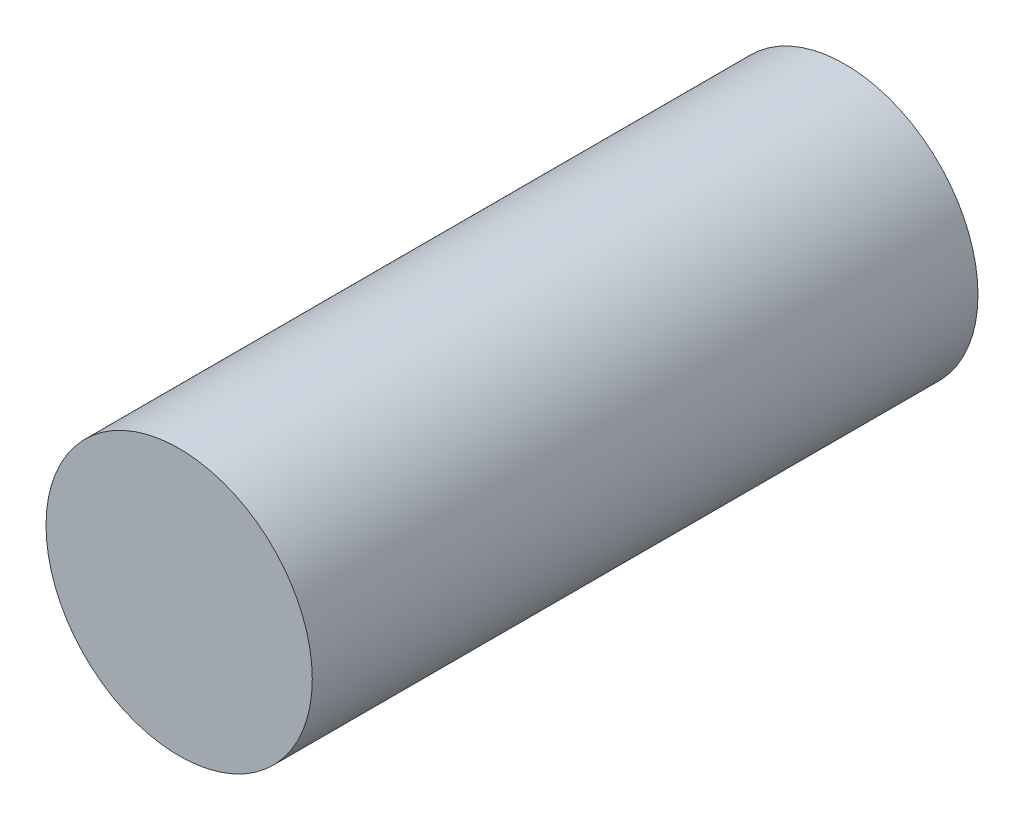
ISO-10303-21;
HEADER;
FILE_DESCRIPTION(('STEP AP214'),'2;1');
FILE_NAME('part.step','',(''),(''),'','','');
FILE_SCHEMA(('AUTOMOTIVE_DESIGN { 1 0 10303 214 1 1 1 1 }'));
ENDSEC;
DATA;
#1=APPLICATION_CONTEXT('core data for automotive mechanical design processes');
#2=APPLICATION_PROTOCOL_DEFINITION('international standard','automotive_design',2000,#1);
#3=PRODUCT_CONTEXT('',#1,'mechanical');
#4=PRODUCT('Part','Part','',(#3));
#5=PRODUCT_RELATED_PRODUCT_CATEGORY('part','',(#4));
#6=PRODUCT_DEFINITION_FORMATION('','',#4);
#7=PRODUCT_DEFINITION_CONTEXT('part definition',#1,'design');
#8=PRODUCT_DEFINITION('design','',#6,#7);
#9=PRODUCT_DEFINITION_SHAPE('','',#8);
#10=(LENGTH_UNIT() NAMED_UNIT(*) SI_UNIT(.MILLI.,.METRE.));
#11=(NAMED_UNIT(*) PLANE_ANGLE_UNIT() SI_UNIT($,.RADIAN.));
#12=(NAMED_UNIT(*) SI_UNIT($,.STERADIAN.) SOLID_ANGLE_UNIT());
#13=UNCERTAINTY_MEASURE_WITH_UNIT(LENGTH_MEASURE(1.E-05),#10,'distance_accuracy_value','');
#14=(GEOMETRIC_REPRESENTATION_CONTEXT(3) GLOBAL_UNCERTAINTY_ASSIGNED_CONTEXT((#13)) GLOBAL_UNIT_ASSIGNED_CONTEXT((#10,
#11,#12)) REPRESENTATION_CONTEXT('',''));
#15=CARTESIAN_POINT('',(0.,0.,0.));
#16=DIRECTION('',(0.,0.,1.));
#17=DIRECTION('',(1.,0.,0.));
#18=AXIS2_PLACEMENT_3D('',#15,#16,#17);
#19=CARTESIAN_POINT('',(-5.39999999999999,0.,-2.5));
#20=DIRECTION('',(0.,0.,-1.));
#21=DIRECTION('',(-1.,0.,0.));
#22=AXIS2_PLACEMENT_3D('',#19,#20,#21);
#23=PLANE('',#22);
#24=CARTESIAN_POINT('',(-5.4,0.,-2.5));
#25=DIRECTION('',(0.,0.,-1.));
#26=DIRECTION('',(-1.,0.,0.));
#27=AXIS2_PLACEMENT_3D('',#24,#25,#26);
#28=CIRCLE('',#27,0.599999999999999);
#29=CARTESIAN_POINT('',(-6.,0.,-2.5));
#30=VERTEX_POINT('',#29);
#31=EDGE_CURVE('E18',#30,#30,#28,.F.);
#32=ORIENTED_EDGE('',*,*,#31,.F.);
#33=EDGE_LOOP('',(#32));
#34=FACE_BOUND('',#33,.T.);
#35=ADVANCED_FACE('F15',(#34),#23,.T.);
#36=CARTESIAN_POINT('',(-5.4,0.,0.499999999999999));
#37=DIRECTION('',(0.,0.,-1.));
#38=DIRECTION('',(-1.,0.,0.));
#39=AXIS2_PLACEMENT_3D('',#36,#37,#38);
#40=PLANE('',#39);
#41=CARTESIAN_POINT('',(-5.4,0.,0.499999999999999));
#42=DIRECTION('',(0.,0.,-1.));
#43=DIRECTION('',(-1.,0.,0.));
#44=AXIS2_PLACEMENT_3D('',#41,#42,#43);
#45=CIRCLE('',#44,0.599999999999999);
#46=CARTESIAN_POINT('',(-6.,0.,0.499999999999999));
#47=VERTEX_POINT('',#46);
#48=EDGE_CURVE('E10',#47,#47,#45,.T.);
#49=ORIENTED_EDGE('',*,*,#48,.F.);
#50=EDGE_LOOP('',(#49));
#51=FACE_BOUND('',#50,.T.);
#52=ADVANCED_FACE('F30',(#51),#40,.F.);
#53=CARTESIAN_POINT('',(-5.4,0.,0.499999999999999));
#54=DIRECTION('',(0.,0.,-1.));
#55=DIRECTION('',(-1.,0.,0.));
#56=AXIS2_PLACEMENT_3D('',#53,#54,#55);
#57=CYLINDRICAL_SURFACE('',#56,0.599999999999999);
#58=ORIENTED_EDGE('',*,*,#48,.T.);
#59=EDGE_LOOP('',(#58));
#60=FACE_BOUND('',#59,.T.);
#61=ORIENTED_EDGE('',*,*,#31,.T.);
#62=EDGE_LOOP('',(#61));
#63=FACE_BOUND('',#62,.T.);
#64=ADVANCED_FACE('F27',(#60,#63),#57,.T.);
#65=CLOSED_SHELL('',(#35,#52,#64));
#66=MANIFOLD_SOLID_BREP('B1',#65);
#67=ADVANCED_BREP_SHAPE_REPRESENTATION('',(#18,#66),#14);
#68=SHAPE_DEFINITION_REPRESENTATION(#9,#67);
ENDSEC;
END-ISO-10303-21;
